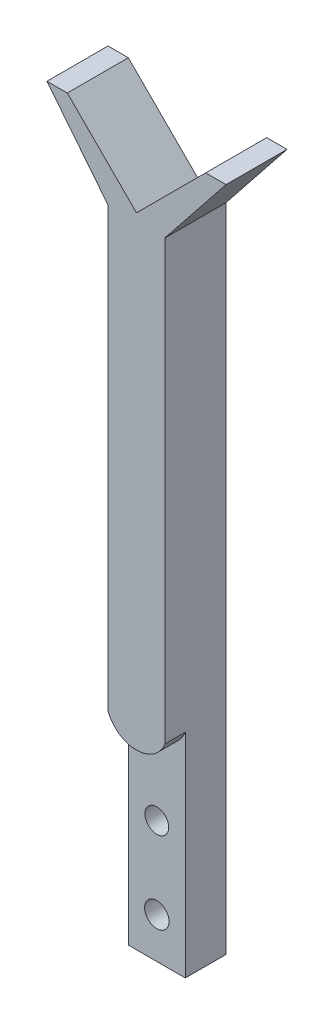
ISO-10303-21;
HEADER;
FILE_DESCRIPTION(('STEP AP214'),'2;1');
FILE_NAME('part.step','',(''),(''),'','','');
FILE_SCHEMA(('AUTOMOTIVE_DESIGN { 1 0 10303 214 1 1 1 1 }'));
ENDSEC;
DATA;
#1=APPLICATION_CONTEXT('core data for automotive mechanical design processes');
#2=APPLICATION_PROTOCOL_DEFINITION('international standard','automotive_design',2000,#1);
#3=PRODUCT_CONTEXT('',#1,'mechanical');
#4=PRODUCT('Part','Part','',(#3));
#5=PRODUCT_RELATED_PRODUCT_CATEGORY('part','',(#4));
#6=PRODUCT_DEFINITION_FORMATION('','',#4);
#7=PRODUCT_DEFINITION_CONTEXT('part definition',#1,'design');
#8=PRODUCT_DEFINITION('design','',#6,#7);
#9=PRODUCT_DEFINITION_SHAPE('','',#8);
#10=(LENGTH_UNIT() NAMED_UNIT(*) SI_UNIT(.MILLI.,.METRE.));
#11=(NAMED_UNIT(*) PLANE_ANGLE_UNIT() SI_UNIT($,.RADIAN.));
#12=(NAMED_UNIT(*) SI_UNIT($,.STERADIAN.) SOLID_ANGLE_UNIT());
#13=UNCERTAINTY_MEASURE_WITH_UNIT(LENGTH_MEASURE(1.E-05),#10,'distance_accuracy_value','');
#14=(GEOMETRIC_REPRESENTATION_CONTEXT(3) GLOBAL_UNCERTAINTY_ASSIGNED_CONTEXT((#13)) GLOBAL_UNIT_ASSIGNED_CONTEXT((#10,
#11,#12)) REPRESENTATION_CONTEXT('',''));
#15=CARTESIAN_POINT('',(0.,0.,0.));
#16=DIRECTION('',(0.,0.,1.));
#17=DIRECTION('',(1.,0.,0.));
#18=AXIS2_PLACEMENT_3D('',#15,#16,#17);
#19=CARTESIAN_POINT('',(-6.99999999999998,-162.83,15.));
#20=DIRECTION('',(0.,1.,0.));
#21=DIRECTION('',(0.,0.,1.));
#22=AXIS2_PLACEMENT_3D('',#19,#20,#21);
#23=PLANE('',#22);
#24=DIRECTION('',(1.,0.,0.));
#25=VECTOR('',#24,1.);
#26=CARTESIAN_POINT('',(-6.99999999999998,-162.83,10.));
#27=LINE('',#26,#25);
#28=CARTESIAN_POINT('',(-6.99999999999998,-162.83,10.));
#29=VERTEX_POINT('',#28);
#30=CARTESIAN_POINT('',(7.00000000000002,-162.83,10.));
#31=VERTEX_POINT('',#30);
#32=EDGE_CURVE('E186',#29,#31,#27,.T.);
#33=ORIENTED_EDGE('',*,*,#32,.F.);
#34=DIRECTION('',(0.,0.,-1.));
#35=VECTOR('',#34,1.);
#36=CARTESIAN_POINT('',(-6.99999999999998,-162.83,15.));
#37=LINE('',#36,#35);
#38=CARTESIAN_POINT('',(-6.99999999999998,-162.83,0.));
#39=VERTEX_POINT('',#38);
#40=EDGE_CURVE('E44',#29,#39,#37,.T.);
#41=ORIENTED_EDGE('',*,*,#40,.T.);
#42=DIRECTION('',(1.,0.,0.));
#43=VECTOR('',#42,1.);
#44=CARTESIAN_POINT('',(-6.99999999999998,-162.83,0.));
#45=LINE('',#44,#43);
#46=CARTESIAN_POINT('',(7.00000000000002,-162.83,0.));
#47=VERTEX_POINT('',#46);
#48=EDGE_CURVE('E153',#39,#47,#45,.T.);
#49=ORIENTED_EDGE('',*,*,#48,.T.);
#50=DIRECTION('',(0.,0.,-1.));
#51=VECTOR('',#50,1.);
#52=CARTESIAN_POINT('',(7.00000000000002,-162.83,15.));
#53=LINE('',#52,#51);
#54=EDGE_CURVE('E176',#31,#47,#53,.T.);
#55=ORIENTED_EDGE('',*,*,#54,.F.);
#56=EDGE_LOOP('',(#33,#41,#49,#55));
#57=FACE_BOUND('',#56,.T.);
#58=ADVANCED_FACE('F35',(#57),#23,.F.);
#59=CARTESIAN_POINT('',(0.,-152.83,0.));
#60=DIRECTION('',(0.,0.,1.));
#61=DIRECTION('',(1.,0.,0.));
#62=AXIS2_PLACEMENT_3D('',#59,#60,#61);
#63=CYLINDRICAL_SURFACE('',#62,3.);
#64=CARTESIAN_POINT('',(0.,-152.83,0.));
#65=DIRECTION('',(0.,0.,1.));
#66=DIRECTION('',(1.,0.,0.));
#67=AXIS2_PLACEMENT_3D('',#64,#65,#66);
#68=CIRCLE('',#67,3.);
#69=CARTESIAN_POINT('',(3.00000000000001,-152.83,0.));
#70=VERTEX_POINT('',#69);
#71=EDGE_CURVE('E211',#70,#70,#68,.T.);
#72=ORIENTED_EDGE('',*,*,#71,.F.);
#73=EDGE_LOOP('',(#72));
#74=FACE_BOUND('',#73,.T.);
#75=CARTESIAN_POINT('',(0.,-152.83,10.));
#76=DIRECTION('',(0.,0.,1.));
#77=DIRECTION('',(1.,0.,0.));
#78=AXIS2_PLACEMENT_3D('',#75,#76,#77);
#79=CIRCLE('',#78,3.);
#80=CARTESIAN_POINT('',(3.00000000000001,-152.83,10.));
#81=VERTEX_POINT('',#80);
#82=EDGE_CURVE('E214',#81,#81,#79,.F.);
#83=ORIENTED_EDGE('',*,*,#82,.F.);
#84=EDGE_LOOP('',(#83));
#85=FACE_BOUND('',#84,.T.);
#86=ADVANCED_FACE('F252',(#74,#85),#63,.F.);
#87=CARTESIAN_POINT('',(0.,-132.83,0.));
#88=DIRECTION('',(0.,0.,1.));
#89=DIRECTION('',(1.,0.,0.));
#90=AXIS2_PLACEMENT_3D('',#87,#88,#89);
#91=CYLINDRICAL_SURFACE('',#90,2.925);
#92=CARTESIAN_POINT('',(0.,-132.83,0.));
#93=DIRECTION('',(0.,0.,1.));
#94=DIRECTION('',(1.,0.,0.));
#95=AXIS2_PLACEMENT_3D('',#92,#93,#94);
#96=CIRCLE('',#95,2.925);
#97=CARTESIAN_POINT('',(2.92500000000001,-132.83,0.));
#98=VERTEX_POINT('',#97);
#99=EDGE_CURVE('E150',#98,#98,#96,.T.);
#100=ORIENTED_EDGE('',*,*,#99,.F.);
#101=EDGE_LOOP('',(#100));
#102=FACE_BOUND('',#101,.T.);
#103=CARTESIAN_POINT('',(0.,-132.83,10.));
#104=DIRECTION('',(0.,0.,1.));
#105=DIRECTION('',(1.,0.,0.));
#106=AXIS2_PLACEMENT_3D('',#103,#104,#105);
#107=CIRCLE('',#106,2.925);
#108=CARTESIAN_POINT('',(2.92500000000001,-132.83,10.));
#109=VERTEX_POINT('',#108);
#110=EDGE_CURVE('E39',#109,#109,#107,.F.);
#111=ORIENTED_EDGE('',*,*,#110,.F.);
#112=EDGE_LOOP('',(#111));
#113=FACE_BOUND('',#112,.T.);
#114=ADVANCED_FACE('F257',(#102,#113),#91,.F.);
#115=CARTESIAN_POINT('',(-21.9999999999999,16.,15.));
#116=DIRECTION('',(0.782163928641404,0.6230726993957,0.));
#117=DIRECTION('',(-0.6230726993957,0.782163928641404,0.));
#118=AXIS2_PLACEMENT_3D('',#115,#116,#117);
#119=PLANE('',#118);
#120=DIRECTION('',(0.6230726993957,-0.782163928641404,0.));
#121=VECTOR('',#120,1.);
#122=CARTESIAN_POINT('',(-21.9999999999999,16.,0.));
#123=LINE('',#122,#121);
#124=CARTESIAN_POINT('',(-21.9999999999999,16.,0.));
#125=VERTEX_POINT('',#124);
#126=CARTESIAN_POINT('',(-6.99999999999999,-2.83,0.));
#127=VERTEX_POINT('',#126);
#128=EDGE_CURVE('E146',#125,#127,#123,.T.);
#129=ORIENTED_EDGE('',*,*,#128,.T.);
#130=DIRECTION('',(0.,0.,-1.));
#131=VECTOR('',#130,1.);
#132=CARTESIAN_POINT('',(-6.99999999999999,-2.83,15.));
#133=LINE('',#132,#131);
#134=CARTESIAN_POINT('',(-6.99999999999999,-2.83,15.));
#135=VERTEX_POINT('',#134);
#136=EDGE_CURVE('E11',#135,#127,#133,.T.);
#137=ORIENTED_EDGE('',*,*,#136,.F.);
#138=DIRECTION('',(0.6230726993957,-0.782163928641404,0.));
#139=VECTOR('',#138,1.);
#140=CARTESIAN_POINT('',(-21.9999999999999,16.,15.));
#141=LINE('',#140,#139);
#142=CARTESIAN_POINT('',(-21.9999999999999,16.,15.));
#143=VERTEX_POINT('',#142);
#144=EDGE_CURVE('E166',#143,#135,#141,.T.);
#145=ORIENTED_EDGE('',*,*,#144,.F.);
#146=DIRECTION('',(0.,0.,-1.));
#147=VECTOR('',#146,1.);
#148=CARTESIAN_POINT('',(-21.9999999999999,16.,15.));
#149=LINE('',#148,#147);
#150=EDGE_CURVE('E142',#143,#125,#149,.T.);
#151=ORIENTED_EDGE('',*,*,#150,.T.);
#152=EDGE_LOOP('',(#129,#137,#145,#151));
#153=FACE_BOUND('',#152,.T.);
#154=ADVANCED_FACE('F37',(#153),#119,.F.);
#155=CARTESIAN_POINT('',(-6.99999999999999,-2.83,15.));
#156=DIRECTION('',(1.,0.,0.));
#157=DIRECTION('',(0.,1.,0.));
#158=AXIS2_PLACEMENT_3D('',#155,#156,#157);
#159=PLANE('',#158);
#160=DIRECTION('',(0.,-1.,0.));
#161=VECTOR('',#160,1.);
#162=CARTESIAN_POINT('',(-6.99999999999999,-110.522582403567,10.));
#163=LINE('',#162,#161);
#164=CARTESIAN_POINT('',(-6.99999999999999,-110.522582403567,10.));
#165=VERTEX_POINT('',#164);
#166=EDGE_CURVE('E229',#165,#29,#163,.T.);
#167=ORIENTED_EDGE('',*,*,#166,.F.);
#168=DIRECTION('',(0.,0.,1.));
#169=VECTOR('',#168,1.);
#170=CARTESIAN_POINT('',(-6.99999999999999,-110.522582403567,10.));
#171=LINE('',#170,#169);
#172=CARTESIAN_POINT('',(-6.99999999999999,-110.522582403567,15.));
#173=VERTEX_POINT('',#172);
#174=EDGE_CURVE('E219',#165,#173,#171,.T.);
#175=ORIENTED_EDGE('',*,*,#174,.T.);
#176=DIRECTION('',(0.,-1.,0.));
#177=VECTOR('',#176,1.);
#178=CARTESIAN_POINT('',(-6.99999999999999,-2.83,15.));
#179=LINE('',#178,#177);
#180=EDGE_CURVE('E104',#135,#173,#179,.T.);
#181=ORIENTED_EDGE('',*,*,#180,.F.);
#182=ORIENTED_EDGE('',*,*,#136,.T.);
#183=DIRECTION('',(0.,-1.,0.));
#184=VECTOR('',#183,1.);
#185=CARTESIAN_POINT('',(-6.99999999999999,-2.83,0.));
#186=LINE('',#185,#184);
#187=EDGE_CURVE('E149',#127,#39,#186,.T.);
#188=ORIENTED_EDGE('',*,*,#187,.T.);
#189=ORIENTED_EDGE('',*,*,#40,.F.);
#190=EDGE_LOOP('',(#167,#175,#181,#182,#188,#189));
#191=FACE_BOUND('',#190,.T.);
#192=ADVANCED_FACE('F188',(#191),#159,.F.);
#193=CARTESIAN_POINT('',(6.99999999999999,-2.83,15.));
#194=DIRECTION('',(-1.,0.,0.));
#195=DIRECTION('',(0.,-1.,0.));
#196=AXIS2_PLACEMENT_3D('',#193,#194,#195);
#197=PLANE('',#196);
#198=DIRECTION('',(0.,1.,0.));
#199=VECTOR('',#198,1.);
#200=CARTESIAN_POINT('',(6.99999999999999,-2.83,15.));
#201=LINE('',#200,#199);
#202=CARTESIAN_POINT('',(7.00000000000001,-110.522582403567,15.));
#203=VERTEX_POINT('',#202);
#204=CARTESIAN_POINT('',(6.99999999999999,-2.83,15.));
#205=VERTEX_POINT('',#204);
#206=EDGE_CURVE('E205',#203,#205,#201,.T.);
#207=ORIENTED_EDGE('',*,*,#206,.F.);
#208=DIRECTION('',(0.,0.,1.));
#209=VECTOR('',#208,1.);
#210=CARTESIAN_POINT('',(7.00000000000002,-110.522582403567,10.));
#211=LINE('',#210,#209);
#212=CARTESIAN_POINT('',(7.00000000000002,-110.522582403567,10.));
#213=VERTEX_POINT('',#212);
#214=EDGE_CURVE('E51',#213,#203,#211,.T.);
#215=ORIENTED_EDGE('',*,*,#214,.F.);
#216=DIRECTION('',(0.,1.,0.));
#217=VECTOR('',#216,1.);
#218=CARTESIAN_POINT('',(7.00000000000002,-162.83,10.));
#219=LINE('',#218,#217);
#220=EDGE_CURVE('E221',#31,#213,#219,.T.);
#221=ORIENTED_EDGE('',*,*,#220,.F.);
#222=ORIENTED_EDGE('',*,*,#54,.T.);
#223=DIRECTION('',(0.,1.,0.));
#224=VECTOR('',#223,1.);
#225=CARTESIAN_POINT('',(6.99999999999999,-2.83,0.));
#226=LINE('',#225,#224);
#227=CARTESIAN_POINT('',(6.99999999999999,-2.83,0.));
#228=VERTEX_POINT('',#227);
#229=EDGE_CURVE('E156',#47,#228,#226,.T.);
#230=ORIENTED_EDGE('',*,*,#229,.T.);
#231=DIRECTION('',(0.,0.,-1.));
#232=VECTOR('',#231,1.);
#233=CARTESIAN_POINT('',(6.99999999999999,-2.83,15.));
#234=LINE('',#233,#232);
#235=EDGE_CURVE('E173',#205,#228,#234,.T.);
#236=ORIENTED_EDGE('',*,*,#235,.F.);
#237=EDGE_LOOP('',(#207,#215,#221,#222,#230,#236));
#238=FACE_BOUND('',#237,.T.);
#239=ADVANCED_FACE('F198',(#238),#197,.F.);
#240=CARTESIAN_POINT('',(6.99999999999999,-2.83,15.));
#241=DIRECTION('',(-0.782163928641402,0.623072699395703,0.));
#242=DIRECTION('',(-0.623072699395703,-0.782163928641402,0.));
#243=AXIS2_PLACEMENT_3D('',#240,#241,#242);
#244=PLANE('',#243);
#245=DIRECTION('',(0.623072699395703,0.782163928641402,0.));
#246=VECTOR('',#245,1.);
#247=CARTESIAN_POINT('',(6.99999999999999,-2.83,0.));
#248=LINE('',#247,#246);
#249=CARTESIAN_POINT('',(22.,16.,0.));
#250=VERTEX_POINT('',#249);
#251=EDGE_CURVE('E158',#228,#250,#248,.T.);
#252=ORIENTED_EDGE('',*,*,#251,.T.);
#253=DIRECTION('',(0.,0.,-1.));
#254=VECTOR('',#253,1.);
#255=CARTESIAN_POINT('',(22.,16.,15.));
#256=LINE('',#255,#254);
#257=CARTESIAN_POINT('',(22.,16.,15.));
#258=VERTEX_POINT('',#257);
#259=EDGE_CURVE('E170',#258,#250,#256,.T.);
#260=ORIENTED_EDGE('',*,*,#259,.F.);
#261=DIRECTION('',(0.623072699395703,0.782163928641402,0.));
#262=VECTOR('',#261,1.);
#263=CARTESIAN_POINT('',(6.99999999999999,-2.83,15.));
#264=LINE('',#263,#262);
#265=EDGE_CURVE('E204',#205,#258,#264,.T.);
#266=ORIENTED_EDGE('',*,*,#265,.F.);
#267=ORIENTED_EDGE('',*,*,#235,.T.);
#268=EDGE_LOOP('',(#252,#260,#266,#267));
#269=FACE_BOUND('',#268,.T.);
#270=ADVANCED_FACE('F202',(#269),#244,.F.);
#271=CARTESIAN_POINT('',(22.,16.,15.));
#272=DIRECTION('',(0.,-1.,0.));
#273=DIRECTION('',(1.,0.,0.));
#274=AXIS2_PLACEMENT_3D('',#271,#272,#273);
#275=PLANE('',#274);
#276=DIRECTION('',(-1.,0.,0.));
#277=VECTOR('',#276,1.);
#278=CARTESIAN_POINT('',(22.,16.,0.));
#279=LINE('',#278,#277);
#280=CARTESIAN_POINT('',(17.,16.,0.));
#281=VERTEX_POINT('',#280);
#282=EDGE_CURVE('E160',#250,#281,#279,.T.);
#283=ORIENTED_EDGE('',*,*,#282,.T.);
#284=DIRECTION('',(0.,0.,-1.));
#285=VECTOR('',#284,1.);
#286=CARTESIAN_POINT('',(17.,16.,15.));
#287=LINE('',#286,#285);
#288=CARTESIAN_POINT('',(17.,16.,15.));
#289=VERTEX_POINT('',#288);
#290=EDGE_CURVE('E137',#289,#281,#287,.T.);
#291=ORIENTED_EDGE('',*,*,#290,.F.);
#292=DIRECTION('',(-1.,0.,0.));
#293=VECTOR('',#292,1.);
#294=CARTESIAN_POINT('',(22.,16.,15.));
#295=LINE('',#294,#293);
#296=EDGE_CURVE('E125',#258,#289,#295,.T.);
#297=ORIENTED_EDGE('',*,*,#296,.F.);
#298=ORIENTED_EDGE('',*,*,#259,.T.);
#299=EDGE_LOOP('',(#283,#291,#297,#298));
#300=FACE_BOUND('',#299,.T.);
#301=ADVANCED_FACE('F365',(#300),#275,.F.);
#302=CARTESIAN_POINT('',(17.,16.,15.));
#303=DIRECTION('',(0.707106781186546,-0.707106781186548,0.));
#304=DIRECTION('',(0.707106781186549,0.707106781186547,0.));
#305=AXIS2_PLACEMENT_3D('',#302,#303,#304);
#306=PLANE('',#305);
#307=DIRECTION('',(-0.707106781186549,-0.707106781186547,0.));
#308=VECTOR('',#307,1.);
#309=CARTESIAN_POINT('',(17.,16.,0.));
#310=LINE('',#309,#308);
#311=CARTESIAN_POINT('',(0.,-1.,0.));
#312=VERTEX_POINT('',#311);
#313=EDGE_CURVE('E134',#281,#312,#310,.T.);
#314=ORIENTED_EDGE('',*,*,#313,.T.);
#315=DIRECTION('',(0.,0.,-1.));
#316=VECTOR('',#315,1.);
#317=CARTESIAN_POINT('',(0.,-1.,15.));
#318=LINE('',#317,#316);
#319=CARTESIAN_POINT('',(0.,-1.,15.));
#320=VERTEX_POINT('',#319);
#321=EDGE_CURVE('E131',#320,#312,#318,.T.);
#322=ORIENTED_EDGE('',*,*,#321,.F.);
#323=DIRECTION('',(-0.707106781186549,-0.707106781186547,0.));
#324=VECTOR('',#323,1.);
#325=CARTESIAN_POINT('',(17.,16.,15.));
#326=LINE('',#325,#324);
#327=EDGE_CURVE('E118',#289,#320,#326,.T.);
#328=ORIENTED_EDGE('',*,*,#327,.F.);
#329=ORIENTED_EDGE('',*,*,#290,.T.);
#330=EDGE_LOOP('',(#314,#322,#328,#329));
#331=FACE_BOUND('',#330,.T.);
#332=ADVANCED_FACE('F132',(#331),#306,.F.);
#333=CARTESIAN_POINT('',(0.,-1.,15.));
#334=DIRECTION('',(-0.707106781186549,-0.707106781186546,0.));
#335=DIRECTION('',(0.707106781186546,-0.707106781186549,0.));
#336=AXIS2_PLACEMENT_3D('',#333,#334,#335);
#337=PLANE('',#336);
#338=DIRECTION('',(-0.707106781186546,0.707106781186549,0.));
#339=VECTOR('',#338,1.);
#340=CARTESIAN_POINT('',(0.,-1.,0.));
#341=LINE('',#340,#339);
#342=CARTESIAN_POINT('',(-16.9999999999999,16.,0.));
#343=VERTEX_POINT('',#342);
#344=EDGE_CURVE('E163',#312,#343,#341,.T.);
#345=ORIENTED_EDGE('',*,*,#344,.T.);
#346=DIRECTION('',(0.,0.,-1.));
#347=VECTOR('',#346,1.);
#348=CARTESIAN_POINT('',(-16.9999999999999,16.,15.));
#349=LINE('',#348,#347);
#350=CARTESIAN_POINT('',(-16.9999999999999,16.,15.));
#351=VERTEX_POINT('',#350);
#352=EDGE_CURVE('E138',#351,#343,#349,.T.);
#353=ORIENTED_EDGE('',*,*,#352,.F.);
#354=DIRECTION('',(-0.707106781186546,0.707106781186549,0.));
#355=VECTOR('',#354,1.);
#356=CARTESIAN_POINT('',(0.,-1.,15.));
#357=LINE('',#356,#355);
#358=EDGE_CURVE('E122',#320,#351,#357,.T.);
#359=ORIENTED_EDGE('',*,*,#358,.F.);
#360=ORIENTED_EDGE('',*,*,#321,.T.);
#361=EDGE_LOOP('',(#345,#353,#359,#360));
#362=FACE_BOUND('',#361,.T.);
#363=ADVANCED_FACE('F140',(#362),#337,.F.);
#364=CARTESIAN_POINT('',(-16.9999999999999,16.,15.));
#365=DIRECTION('',(0.,-1.,0.));
#366=DIRECTION('',(0.,0.,-1.));
#367=AXIS2_PLACEMENT_3D('',#364,#365,#366);
#368=PLANE('',#367);
#369=DIRECTION('',(-1.,0.,0.));
#370=VECTOR('',#369,1.);
#371=CARTESIAN_POINT('',(-16.9999999999999,16.,0.));
#372=LINE('',#371,#370);
#373=EDGE_CURVE('E96',#343,#125,#372,.T.);
#374=ORIENTED_EDGE('',*,*,#373,.T.);
#375=ORIENTED_EDGE('',*,*,#150,.F.);
#376=DIRECTION('',(-1.,0.,0.));
#377=VECTOR('',#376,1.);
#378=CARTESIAN_POINT('',(-16.9999999999999,16.,15.));
#379=LINE('',#378,#377);
#380=EDGE_CURVE('E60',#351,#143,#379,.T.);
#381=ORIENTED_EDGE('',*,*,#380,.F.);
#382=ORIENTED_EDGE('',*,*,#352,.T.);
#383=EDGE_LOOP('',(#374,#375,#381,#382));
#384=FACE_BOUND('',#383,.T.);
#385=ADVANCED_FACE('F241',(#384),#368,.F.);
#386=CARTESIAN_POINT('',(0.,0.,15.));
#387=DIRECTION('',(0.,0.,-1.));
#388=DIRECTION('',(-1.,0.,0.));
#389=AXIS2_PLACEMENT_3D('',#386,#387,#388);
#390=PLANE('',#389);
#391=ORIENTED_EDGE('',*,*,#180,.T.);
#392=CARTESIAN_POINT('',(0.,-107.83,15.));
#393=DIRECTION('',(0.,0.,-1.));
#394=DIRECTION('',(1.,0.,0.));
#395=AXIS2_PLACEMENT_3D('',#392,#393,#394);
#396=CIRCLE('',#395,7.5);
#397=EDGE_CURVE('E223',#203,#173,#396,.T.);
#398=ORIENTED_EDGE('',*,*,#397,.F.);
#399=ORIENTED_EDGE('',*,*,#206,.T.);
#400=ORIENTED_EDGE('',*,*,#265,.T.);
#401=ORIENTED_EDGE('',*,*,#296,.T.);
#402=ORIENTED_EDGE('',*,*,#327,.T.);
#403=ORIENTED_EDGE('',*,*,#358,.T.);
#404=ORIENTED_EDGE('',*,*,#380,.T.);
#405=ORIENTED_EDGE('',*,*,#144,.T.);
#406=EDGE_LOOP('',(#391,#398,#399,#400,#401,#402,#403,#404,#405));
#407=FACE_BOUND('',#406,.T.);
#408=ADVANCED_FACE('F120',(#407),#390,.F.);
#409=CARTESIAN_POINT('',(0.,0.,0.));
#410=DIRECTION('',(0.,0.,-1.));
#411=DIRECTION('',(-1.,0.,0.));
#412=AXIS2_PLACEMENT_3D('',#409,#410,#411);
#413=PLANE('',#412);
#414=ORIENTED_EDGE('',*,*,#99,.T.);
#415=EDGE_LOOP('',(#414));
#416=FACE_BOUND('',#415,.T.);
#417=ORIENTED_EDGE('',*,*,#71,.T.);
#418=EDGE_LOOP('',(#417));
#419=FACE_BOUND('',#418,.T.);
#420=ORIENTED_EDGE('',*,*,#128,.F.);
#421=ORIENTED_EDGE('',*,*,#373,.F.);
#422=ORIENTED_EDGE('',*,*,#344,.F.);
#423=ORIENTED_EDGE('',*,*,#313,.F.);
#424=ORIENTED_EDGE('',*,*,#282,.F.);
#425=ORIENTED_EDGE('',*,*,#251,.F.);
#426=ORIENTED_EDGE('',*,*,#229,.F.);
#427=ORIENTED_EDGE('',*,*,#48,.F.);
#428=ORIENTED_EDGE('',*,*,#187,.F.);
#429=EDGE_LOOP('',(#420,#421,#422,#423,#424,#425,#426,#427,#428));
#430=FACE_BOUND('',#429,.T.);
#431=ADVANCED_FACE('F192',(#416,#419,#430),#413,.T.);
#432=CARTESIAN_POINT('',(0.,-107.83,10.));
#433=DIRECTION('',(0.,0.,1.));
#434=DIRECTION('',(1.,0.,0.));
#435=AXIS2_PLACEMENT_3D('',#432,#433,#434);
#436=PLANE('',#435);
#437=CARTESIAN_POINT('',(0.,-107.83,10.));
#438=DIRECTION('',(0.,0.,-1.));
#439=DIRECTION('',(1.,0.,0.));
#440=AXIS2_PLACEMENT_3D('',#437,#438,#439);
#441=CIRCLE('',#440,7.5);
#442=EDGE_CURVE('E225',#213,#165,#441,.T.);
#443=ORIENTED_EDGE('',*,*,#442,.T.);
#444=ORIENTED_EDGE('',*,*,#166,.T.);
#445=ORIENTED_EDGE('',*,*,#32,.T.);
#446=ORIENTED_EDGE('',*,*,#220,.T.);
#447=EDGE_LOOP('',(#443,#444,#445,#446));
#448=FACE_BOUND('',#447,.T.);
#449=ORIENTED_EDGE('',*,*,#110,.T.);
#450=EDGE_LOOP('',(#449));
#451=FACE_BOUND('',#450,.T.);
#452=ORIENTED_EDGE('',*,*,#82,.T.);
#453=EDGE_LOOP('',(#452));
#454=FACE_BOUND('',#453,.T.);
#455=ADVANCED_FACE('F235',(#448,#451,#454),#436,.T.);
#456=CARTESIAN_POINT('',(0.,-107.83,10.));
#457=DIRECTION('',(0.,0.,1.));
#458=DIRECTION('',(1.,0.,0.));
#459=AXIS2_PLACEMENT_3D('',#456,#457,#458);
#460=CYLINDRICAL_SURFACE('',#459,7.5);
#461=ORIENTED_EDGE('',*,*,#397,.T.);
#462=ORIENTED_EDGE('',*,*,#174,.F.);
#463=ORIENTED_EDGE('',*,*,#442,.F.);
#464=ORIENTED_EDGE('',*,*,#214,.T.);
#465=EDGE_LOOP('',(#461,#462,#463,#464));
#466=FACE_BOUND('',#465,.T.);
#467=ADVANCED_FACE('F277',(#466),#460,.T.);
#468=CLOSED_SHELL('',(#58,#86,#114,#154,#192,#239,#270,#301,#332,#363,#385,#408,#431,#455,#467));
#469=MANIFOLD_SOLID_BREP('B2',#468);
#470=ADVANCED_BREP_SHAPE_REPRESENTATION('',(#18,#469),#14);
#471=SHAPE_DEFINITION_REPRESENTATION(#9,#470);
ENDSEC;
END-ISO-10303-21;
